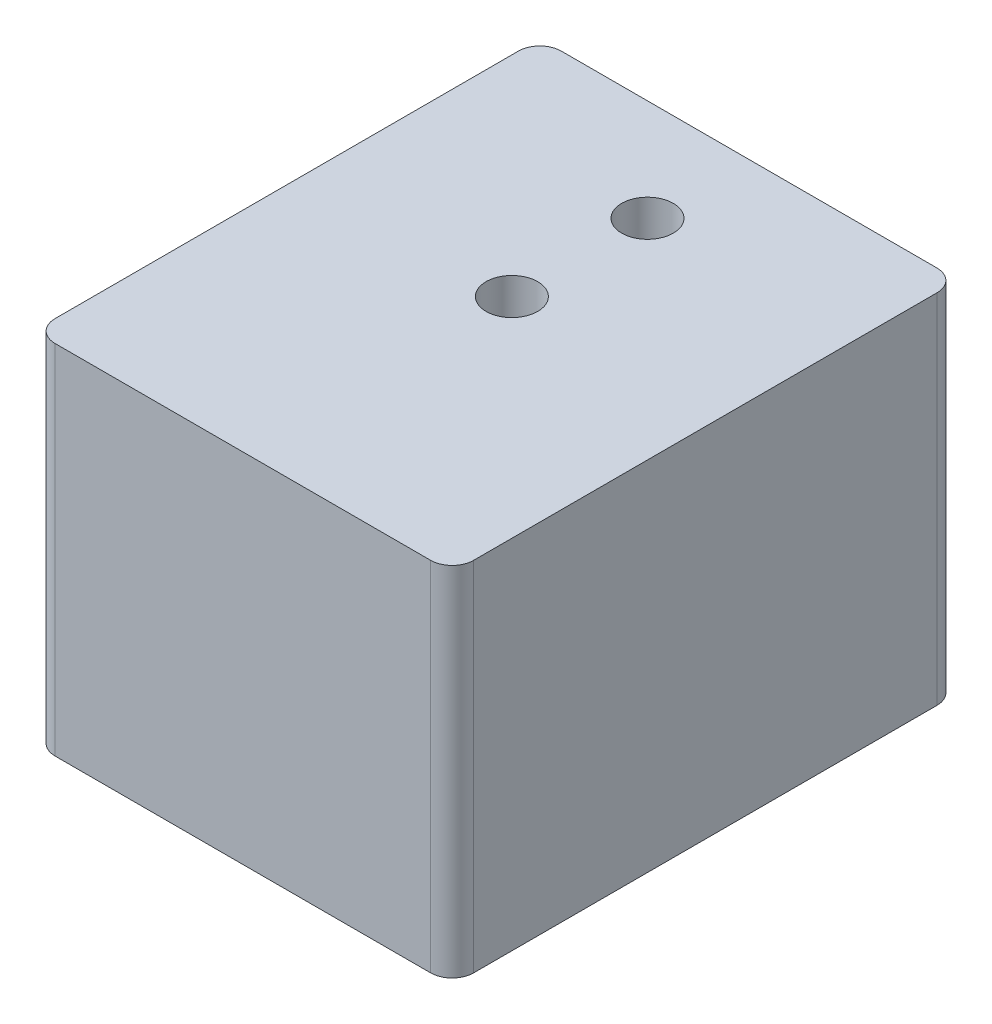
ISO-10303-21;
HEADER;
FILE_DESCRIPTION(('STEP AP214'),'2;1');
FILE_NAME('part.step','',(''),(''),'','','');
FILE_SCHEMA(('AUTOMOTIVE_DESIGN { 1 0 10303 214 1 1 1 1 }'));
ENDSEC;
DATA;
#1=APPLICATION_CONTEXT('core data for automotive mechanical design processes');
#2=APPLICATION_PROTOCOL_DEFINITION('international standard','automotive_design',2000,#1);
#3=PRODUCT_CONTEXT('',#1,'mechanical');
#4=PRODUCT('Part','Part','',(#3));
#5=PRODUCT_RELATED_PRODUCT_CATEGORY('part','',(#4));
#6=PRODUCT_DEFINITION_FORMATION('','',#4);
#7=PRODUCT_DEFINITION_CONTEXT('part definition',#1,'design');
#8=PRODUCT_DEFINITION('design','',#6,#7);
#9=PRODUCT_DEFINITION_SHAPE('','',#8);
#10=(LENGTH_UNIT() NAMED_UNIT(*) SI_UNIT(.MILLI.,.METRE.));
#11=(NAMED_UNIT(*) PLANE_ANGLE_UNIT() SI_UNIT($,.RADIAN.));
#12=(NAMED_UNIT(*) SI_UNIT($,.STERADIAN.) SOLID_ANGLE_UNIT());
#13=UNCERTAINTY_MEASURE_WITH_UNIT(LENGTH_MEASURE(1.E-05),#10,'distance_accuracy_value','');
#14=(GEOMETRIC_REPRESENTATION_CONTEXT(3) GLOBAL_UNCERTAINTY_ASSIGNED_CONTEXT((#13)) GLOBAL_UNIT_ASSIGNED_CONTEXT((#10,
#11,#12)) REPRESENTATION_CONTEXT('',''));
#15=CARTESIAN_POINT('',(0.,0.,0.));
#16=DIRECTION('',(0.,0.,1.));
#17=DIRECTION('',(1.,0.,0.));
#18=AXIS2_PLACEMENT_3D('',#15,#16,#17);
#19=CARTESIAN_POINT('',(0.,21.082,0.));
#20=DIRECTION('',(0.,-1.,0.));
#21=DIRECTION('',(0.,0.,-1.));
#22=AXIS2_PLACEMENT_3D('',#19,#20,#21);
#23=PLANE('',#22);
#24=DIRECTION('',(-1.,0.,0.));
#25=VECTOR('',#24,1.);
#26=CARTESIAN_POINT('',(0.,21.082,-29.87499994));
#27=LINE('',#26,#25);
#28=CARTESIAN_POINT('',(23.429999876,21.082,-29.87499994));
#29=VERTEX_POINT('',#28);
#30=CARTESIAN_POINT('',(1.27,21.082,-29.87499994));
#31=VERTEX_POINT('',#30);
#32=EDGE_CURVE('E137',#29,#31,#27,.T.);
#33=ORIENTED_EDGE('',*,*,#32,.T.);
#34=CARTESIAN_POINT('',(1.27,21.082,-28.60499994));
#35=DIRECTION('',(0.,-1.,0.));
#36=DIRECTION('',(0.,0.,-1.));
#37=AXIS2_PLACEMENT_3D('',#34,#35,#36);
#38=CIRCLE('',#37,1.27);
#39=CARTESIAN_POINT('',(0.,21.082,-28.60499994));
#40=VERTEX_POINT('',#39);
#41=EDGE_CURVE('E156',#31,#40,#38,.F.);
#42=ORIENTED_EDGE('',*,*,#41,.T.);
#43=DIRECTION('',(0.,0.,1.));
#44=VECTOR('',#43,1.);
#45=CARTESIAN_POINT('',(0.,21.082,0.));
#46=LINE('',#45,#44);
#47=CARTESIAN_POINT('',(0.,21.082,-1.27));
#48=VERTEX_POINT('',#47);
#49=EDGE_CURVE('E120',#40,#48,#46,.T.);
#50=ORIENTED_EDGE('',*,*,#49,.T.);
#51=CARTESIAN_POINT('',(1.27,21.082,-1.27));
#52=DIRECTION('',(0.,-1.,0.));
#53=DIRECTION('',(0.,0.,-1.));
#54=AXIS2_PLACEMENT_3D('',#51,#52,#53);
#55=CIRCLE('',#54,1.27);
#56=CARTESIAN_POINT('',(1.27,21.082,0.));
#57=VERTEX_POINT('',#56);
#58=EDGE_CURVE('E151',#48,#57,#55,.F.);
#59=ORIENTED_EDGE('',*,*,#58,.T.);
#60=DIRECTION('',(1.,0.,0.));
#61=VECTOR('',#60,1.);
#62=CARTESIAN_POINT('',(0.,21.082,0.));
#63=LINE('',#62,#61);
#64=CARTESIAN_POINT('',(23.429999876,21.082,0.));
#65=VERTEX_POINT('',#64);
#66=EDGE_CURVE('E167',#57,#65,#63,.T.);
#67=ORIENTED_EDGE('',*,*,#66,.T.);
#68=CARTESIAN_POINT('',(23.429999876,21.082,-1.27));
#69=DIRECTION('',(0.,-1.,0.));
#70=DIRECTION('',(0.,0.,-1.));
#71=AXIS2_PLACEMENT_3D('',#68,#69,#70);
#72=CIRCLE('',#71,1.27);
#73=CARTESIAN_POINT('',(24.699999876,21.082,-1.27));
#74=VERTEX_POINT('',#73);
#75=EDGE_CURVE('E56',#65,#74,#72,.F.);
#76=ORIENTED_EDGE('',*,*,#75,.T.);
#77=DIRECTION('',(0.,0.,-1.));
#78=VECTOR('',#77,1.);
#79=CARTESIAN_POINT('',(24.699999876,21.082,0.));
#80=LINE('',#79,#78);
#81=CARTESIAN_POINT('',(24.699999876,21.082,-28.60499994));
#82=VERTEX_POINT('',#81);
#83=EDGE_CURVE('E175',#74,#82,#80,.T.);
#84=ORIENTED_EDGE('',*,*,#83,.T.);
#85=CARTESIAN_POINT('',(23.429999876,21.082,-28.60499994));
#86=DIRECTION('',(0.,-1.,0.));
#87=DIRECTION('',(0.,0.,-1.));
#88=AXIS2_PLACEMENT_3D('',#85,#86,#87);
#89=CIRCLE('',#88,1.27);
#90=EDGE_CURVE('E154',#82,#29,#89,.F.);
#91=ORIENTED_EDGE('',*,*,#90,.T.);
#92=EDGE_LOOP('',(#33,#42,#50,#59,#67,#76,#84,#91));
#93=FACE_BOUND('',#92,.T.);
#94=CARTESIAN_POINT('',(12.349999938,21.082,-15.875));
#95=DIRECTION('',(0.,1.,0.));
#96=DIRECTION('',(0.,0.,1.));
#97=AXIS2_PLACEMENT_3D('',#94,#95,#96);
#98=CIRCLE('',#97,1.524);
#99=CARTESIAN_POINT('',(12.349999938,21.082,-14.351));
#100=VERTEX_POINT('',#99);
#101=EDGE_CURVE('E128',#100,#100,#98,.T.);
#102=ORIENTED_EDGE('',*,*,#101,.F.);
#103=EDGE_LOOP('',(#102));
#104=FACE_BOUND('',#103,.T.);
#105=CARTESIAN_POINT('',(12.349999938,21.082,-23.875000002));
#106=DIRECTION('',(0.,1.,0.));
#107=DIRECTION('',(0.,0.,1.));
#108=AXIS2_PLACEMENT_3D('',#105,#106,#107);
#109=CIRCLE('',#108,1.524);
#110=CARTESIAN_POINT('',(12.349999938,21.082,-22.351000002));
#111=VERTEX_POINT('',#110);
#112=EDGE_CURVE('E182',#111,#111,#109,.T.);
#113=ORIENTED_EDGE('',*,*,#112,.F.);
#114=EDGE_LOOP('',(#113));
#115=FACE_BOUND('',#114,.T.);
#116=ADVANCED_FACE('F34',(#93,#104,#115),#23,.F.);
#117=CARTESIAN_POINT('',(0.,0.,0.));
#118=DIRECTION('',(0.,-1.,0.));
#119=DIRECTION('',(0.,0.,-1.));
#120=AXIS2_PLACEMENT_3D('',#117,#118,#119);
#121=PLANE('',#120);
#122=CARTESIAN_POINT('',(12.349999938,0.,-15.875));
#123=DIRECTION('',(0.,1.,0.));
#124=DIRECTION('',(0.,0.,1.));
#125=AXIS2_PLACEMENT_3D('',#122,#123,#124);
#126=CIRCLE('',#125,1.524);
#127=CARTESIAN_POINT('',(12.349999938,0.,-14.351));
#128=VERTEX_POINT('',#127);
#129=EDGE_CURVE('E134',#128,#128,#126,.T.);
#130=ORIENTED_EDGE('',*,*,#129,.T.);
#131=EDGE_LOOP('',(#130));
#132=FACE_BOUND('',#131,.T.);
#133=DIRECTION('',(0.,0.,1.));
#134=VECTOR('',#133,1.);
#135=CARTESIAN_POINT('',(0.,0.,0.));
#136=LINE('',#135,#134);
#137=CARTESIAN_POINT('',(0.,0.,-28.60499994));
#138=VERTEX_POINT('',#137);
#139=CARTESIAN_POINT('',(0.,0.,-1.27));
#140=VERTEX_POINT('',#139);
#141=EDGE_CURVE('E117',#138,#140,#136,.T.);
#142=ORIENTED_EDGE('',*,*,#141,.F.);
#143=CARTESIAN_POINT('',(1.27,0.,-28.60499994));
#144=DIRECTION('',(0.,-1.,0.));
#145=DIRECTION('',(0.,0.,-1.));
#146=AXIS2_PLACEMENT_3D('',#143,#144,#145);
#147=CIRCLE('',#146,1.27);
#148=CARTESIAN_POINT('',(1.27,0.,-29.87499994));
#149=VERTEX_POINT('',#148);
#150=EDGE_CURVE('E100',#138,#149,#147,.T.);
#151=ORIENTED_EDGE('',*,*,#150,.T.);
#152=DIRECTION('',(-1.,0.,0.));
#153=VECTOR('',#152,1.);
#154=CARTESIAN_POINT('',(0.,0.,-29.87499994));
#155=LINE('',#154,#153);
#156=CARTESIAN_POINT('',(23.429999876,0.,-29.87499994));
#157=VERTEX_POINT('',#156);
#158=EDGE_CURVE('E141',#157,#149,#155,.T.);
#159=ORIENTED_EDGE('',*,*,#158,.F.);
#160=CARTESIAN_POINT('',(23.429999876,0.,-28.60499994));
#161=DIRECTION('',(0.,-1.,0.));
#162=DIRECTION('',(0.,0.,-1.));
#163=AXIS2_PLACEMENT_3D('',#160,#161,#162);
#164=CIRCLE('',#163,1.27);
#165=CARTESIAN_POINT('',(24.699999876,0.,-28.60499994));
#166=VERTEX_POINT('',#165);
#167=EDGE_CURVE('E111',#157,#166,#164,.T.);
#168=ORIENTED_EDGE('',*,*,#167,.T.);
#169=DIRECTION('',(0.,0.,-1.));
#170=VECTOR('',#169,1.);
#171=CARTESIAN_POINT('',(24.699999876,0.,0.));
#172=LINE('',#171,#170);
#173=CARTESIAN_POINT('',(24.699999876,0.,-1.27));
#174=VERTEX_POINT('',#173);
#175=EDGE_CURVE('E131',#174,#166,#172,.T.);
#176=ORIENTED_EDGE('',*,*,#175,.F.);
#177=CARTESIAN_POINT('',(23.429999876,0.,-1.27));
#178=DIRECTION('',(0.,-1.,0.));
#179=DIRECTION('',(0.,0.,-1.));
#180=AXIS2_PLACEMENT_3D('',#177,#178,#179);
#181=CIRCLE('',#180,1.27);
#182=CARTESIAN_POINT('',(23.429999876,0.,0.));
#183=VERTEX_POINT('',#182);
#184=EDGE_CURVE('E145',#174,#183,#181,.T.);
#185=ORIENTED_EDGE('',*,*,#184,.T.);
#186=DIRECTION('',(1.,0.,0.));
#187=VECTOR('',#186,1.);
#188=CARTESIAN_POINT('',(0.,0.,0.));
#189=LINE('',#188,#187);
#190=CARTESIAN_POINT('',(1.27,0.,0.));
#191=VERTEX_POINT('',#190);
#192=EDGE_CURVE('E127',#191,#183,#189,.T.);
#193=ORIENTED_EDGE('',*,*,#192,.F.);
#194=CARTESIAN_POINT('',(1.27,0.,-1.27));
#195=DIRECTION('',(0.,-1.,0.));
#196=DIRECTION('',(0.,0.,-1.));
#197=AXIS2_PLACEMENT_3D('',#194,#195,#196);
#198=CIRCLE('',#197,1.27);
#199=EDGE_CURVE('E121',#191,#140,#198,.T.);
#200=ORIENTED_EDGE('',*,*,#199,.T.);
#201=EDGE_LOOP('',(#142,#151,#159,#168,#176,#185,#193,#200));
#202=FACE_BOUND('',#201,.T.);
#203=CARTESIAN_POINT('',(12.349999938,0.,-23.875000002));
#204=DIRECTION('',(0.,1.,0.));
#205=DIRECTION('',(0.,0.,1.));
#206=AXIS2_PLACEMENT_3D('',#203,#204,#205);
#207=CIRCLE('',#206,1.524);
#208=CARTESIAN_POINT('',(12.349999938,0.,-22.351000002));
#209=VERTEX_POINT('',#208);
#210=EDGE_CURVE('E184',#209,#209,#207,.T.);
#211=ORIENTED_EDGE('',*,*,#210,.T.);
#212=EDGE_LOOP('',(#211));
#213=FACE_BOUND('',#212,.T.);
#214=ADVANCED_FACE('F124',(#132,#202,#213),#121,.T.);
#215=CARTESIAN_POINT('',(0.,21.082,0.));
#216=DIRECTION('',(1.,0.,0.));
#217=DIRECTION('',(0.,0.,-1.));
#218=AXIS2_PLACEMENT_3D('',#215,#216,#217);
#219=PLANE('',#218);
#220=ORIENTED_EDGE('',*,*,#49,.F.);
#221=DIRECTION('',(0.,-1.,0.));
#222=VECTOR('',#221,1.);
#223=CARTESIAN_POINT('',(0.,21.082,-28.60499994));
#224=LINE('',#223,#222);
#225=EDGE_CURVE('E104',#40,#138,#224,.T.);
#226=ORIENTED_EDGE('',*,*,#225,.T.);
#227=ORIENTED_EDGE('',*,*,#141,.T.);
#228=DIRECTION('',(0.,-1.,0.));
#229=VECTOR('',#228,1.);
#230=CARTESIAN_POINT('',(0.,21.082,-1.27));
#231=LINE('',#230,#229);
#232=EDGE_CURVE('E122',#140,#48,#231,.F.);
#233=ORIENTED_EDGE('',*,*,#232,.T.);
#234=EDGE_LOOP('',(#220,#226,#227,#233));
#235=FACE_BOUND('',#234,.T.);
#236=ADVANCED_FACE('F116',(#235),#219,.F.);
#237=CARTESIAN_POINT('',(0.,21.082,0.));
#238=DIRECTION('',(0.,0.,-1.));
#239=DIRECTION('',(-1.,0.,0.));
#240=AXIS2_PLACEMENT_3D('',#237,#238,#239);
#241=PLANE('',#240);
#242=ORIENTED_EDGE('',*,*,#192,.T.);
#243=DIRECTION('',(0.,-1.,0.));
#244=VECTOR('',#243,1.);
#245=CARTESIAN_POINT('',(23.429999876,21.082,0.));
#246=LINE('',#245,#244);
#247=EDGE_CURVE('E11',#183,#65,#246,.F.);
#248=ORIENTED_EDGE('',*,*,#247,.T.);
#249=ORIENTED_EDGE('',*,*,#66,.F.);
#250=DIRECTION('',(0.,-1.,0.));
#251=VECTOR('',#250,1.);
#252=CARTESIAN_POINT('',(1.27,21.082,0.));
#253=LINE('',#252,#251);
#254=EDGE_CURVE('E42',#57,#191,#253,.T.);
#255=ORIENTED_EDGE('',*,*,#254,.T.);
#256=EDGE_LOOP('',(#242,#248,#249,#255));
#257=FACE_BOUND('',#256,.T.);
#258=ADVANCED_FACE('F165',(#257),#241,.F.);
#259=CARTESIAN_POINT('',(24.699999876,21.082,0.));
#260=DIRECTION('',(-1.,0.,0.));
#261=DIRECTION('',(0.,0.,1.));
#262=AXIS2_PLACEMENT_3D('',#259,#260,#261);
#263=PLANE('',#262);
#264=ORIENTED_EDGE('',*,*,#175,.T.);
#265=DIRECTION('',(0.,-1.,0.));
#266=VECTOR('',#265,1.);
#267=CARTESIAN_POINT('',(24.699999876,21.082,-28.60499994));
#268=LINE('',#267,#266);
#269=EDGE_CURVE('E49',#166,#82,#268,.F.);
#270=ORIENTED_EDGE('',*,*,#269,.T.);
#271=ORIENTED_EDGE('',*,*,#83,.F.);
#272=DIRECTION('',(0.,-1.,0.));
#273=VECTOR('',#272,1.);
#274=CARTESIAN_POINT('',(24.699999876,21.082,-1.27));
#275=LINE('',#274,#273);
#276=EDGE_CURVE('E158',#74,#174,#275,.T.);
#277=ORIENTED_EDGE('',*,*,#276,.T.);
#278=EDGE_LOOP('',(#264,#270,#271,#277));
#279=FACE_BOUND('',#278,.T.);
#280=ADVANCED_FACE('F174',(#279),#263,.F.);
#281=CARTESIAN_POINT('',(0.,21.082,-29.87499994));
#282=DIRECTION('',(0.,0.,1.));
#283=DIRECTION('',(1.,0.,0.));
#284=AXIS2_PLACEMENT_3D('',#281,#282,#283);
#285=PLANE('',#284);
#286=ORIENTED_EDGE('',*,*,#158,.T.);
#287=DIRECTION('',(0.,-1.,0.));
#288=VECTOR('',#287,1.);
#289=CARTESIAN_POINT('',(1.27,21.082,-29.87499994));
#290=LINE('',#289,#288);
#291=EDGE_CURVE('E105',#149,#31,#290,.F.);
#292=ORIENTED_EDGE('',*,*,#291,.T.);
#293=ORIENTED_EDGE('',*,*,#32,.F.);
#294=DIRECTION('',(0.,-1.,0.));
#295=VECTOR('',#294,1.);
#296=CARTESIAN_POINT('',(23.429999876,21.082,-29.87499994));
#297=LINE('',#296,#295);
#298=EDGE_CURVE('E110',#29,#157,#297,.T.);
#299=ORIENTED_EDGE('',*,*,#298,.T.);
#300=EDGE_LOOP('',(#286,#292,#293,#299));
#301=FACE_BOUND('',#300,.T.);
#302=ADVANCED_FACE('F205',(#301),#285,.F.);
#303=CARTESIAN_POINT('',(12.349999938,21.082,-15.875));
#304=DIRECTION('',(0.,-1.,0.));
#305=DIRECTION('',(0.,0.,-1.));
#306=AXIS2_PLACEMENT_3D('',#303,#304,#305);
#307=CYLINDRICAL_SURFACE('',#306,1.524);
#308=ORIENTED_EDGE('',*,*,#101,.T.);
#309=EDGE_LOOP('',(#308));
#310=FACE_BOUND('',#309,.T.);
#311=ORIENTED_EDGE('',*,*,#129,.F.);
#312=EDGE_LOOP('',(#311));
#313=FACE_BOUND('',#312,.T.);
#314=ADVANCED_FACE('F202',(#310,#313),#307,.F.);
#315=CARTESIAN_POINT('',(12.349999938,21.082,-23.875000002));
#316=DIRECTION('',(0.,-1.,0.));
#317=DIRECTION('',(0.,0.,-1.));
#318=AXIS2_PLACEMENT_3D('',#315,#316,#317);
#319=CYLINDRICAL_SURFACE('',#318,1.524);
#320=ORIENTED_EDGE('',*,*,#112,.T.);
#321=EDGE_LOOP('',(#320));
#322=FACE_BOUND('',#321,.T.);
#323=ORIENTED_EDGE('',*,*,#210,.F.);
#324=EDGE_LOOP('',(#323));
#325=FACE_BOUND('',#324,.T.);
#326=ADVANCED_FACE('F190',(#322,#325),#319,.F.);
#327=CARTESIAN_POINT('',(1.27,21.082,-28.60499994));
#328=DIRECTION('',(0.,-1.,0.));
#329=DIRECTION('',(0.,0.,-1.));
#330=AXIS2_PLACEMENT_3D('',#327,#328,#329);
#331=CYLINDRICAL_SURFACE('',#330,1.27);
#332=ORIENTED_EDGE('',*,*,#41,.F.);
#333=ORIENTED_EDGE('',*,*,#291,.F.);
#334=ORIENTED_EDGE('',*,*,#150,.F.);
#335=ORIENTED_EDGE('',*,*,#225,.F.);
#336=EDGE_LOOP('',(#332,#333,#334,#335));
#337=FACE_BOUND('',#336,.T.);
#338=ADVANCED_FACE('F103',(#337),#331,.T.);
#339=CARTESIAN_POINT('',(23.429999876,21.082,-28.60499994));
#340=DIRECTION('',(0.,-1.,0.));
#341=DIRECTION('',(0.,0.,-1.));
#342=AXIS2_PLACEMENT_3D('',#339,#340,#341);
#343=CYLINDRICAL_SURFACE('',#342,1.27);
#344=ORIENTED_EDGE('',*,*,#90,.F.);
#345=ORIENTED_EDGE('',*,*,#269,.F.);
#346=ORIENTED_EDGE('',*,*,#167,.F.);
#347=ORIENTED_EDGE('',*,*,#298,.F.);
#348=EDGE_LOOP('',(#344,#345,#346,#347));
#349=FACE_BOUND('',#348,.T.);
#350=ADVANCED_FACE('F217',(#349),#343,.T.);
#351=CARTESIAN_POINT('',(23.429999876,21.082,-1.27));
#352=DIRECTION('',(0.,-1.,0.));
#353=DIRECTION('',(0.,0.,-1.));
#354=AXIS2_PLACEMENT_3D('',#351,#352,#353);
#355=CYLINDRICAL_SURFACE('',#354,1.27);
#356=ORIENTED_EDGE('',*,*,#75,.F.);
#357=ORIENTED_EDGE('',*,*,#247,.F.);
#358=ORIENTED_EDGE('',*,*,#184,.F.);
#359=ORIENTED_EDGE('',*,*,#276,.F.);
#360=EDGE_LOOP('',(#356,#357,#358,#359));
#361=FACE_BOUND('',#360,.T.);
#362=ADVANCED_FACE('F173',(#361),#355,.T.);
#363=CARTESIAN_POINT('',(1.27,21.082,-1.27));
#364=DIRECTION('',(0.,-1.,0.));
#365=DIRECTION('',(0.,0.,-1.));
#366=AXIS2_PLACEMENT_3D('',#363,#364,#365);
#367=CYLINDRICAL_SURFACE('',#366,1.27);
#368=ORIENTED_EDGE('',*,*,#58,.F.);
#369=ORIENTED_EDGE('',*,*,#232,.F.);
#370=ORIENTED_EDGE('',*,*,#199,.F.);
#371=ORIENTED_EDGE('',*,*,#254,.F.);
#372=EDGE_LOOP('',(#368,#369,#370,#371));
#373=FACE_BOUND('',#372,.T.);
#374=ADVANCED_FACE('F36',(#373),#367,.T.);
#375=CLOSED_SHELL('',(#116,#214,#236,#258,#280,#302,#314,#326,#338,#350,#362,#374));
#376=MANIFOLD_SOLID_BREP('B2',#375);
#377=ADVANCED_BREP_SHAPE_REPRESENTATION('',(#18,#376),#14);
#378=SHAPE_DEFINITION_REPRESENTATION(#9,#377);
ENDSEC;
END-ISO-10303-21;
